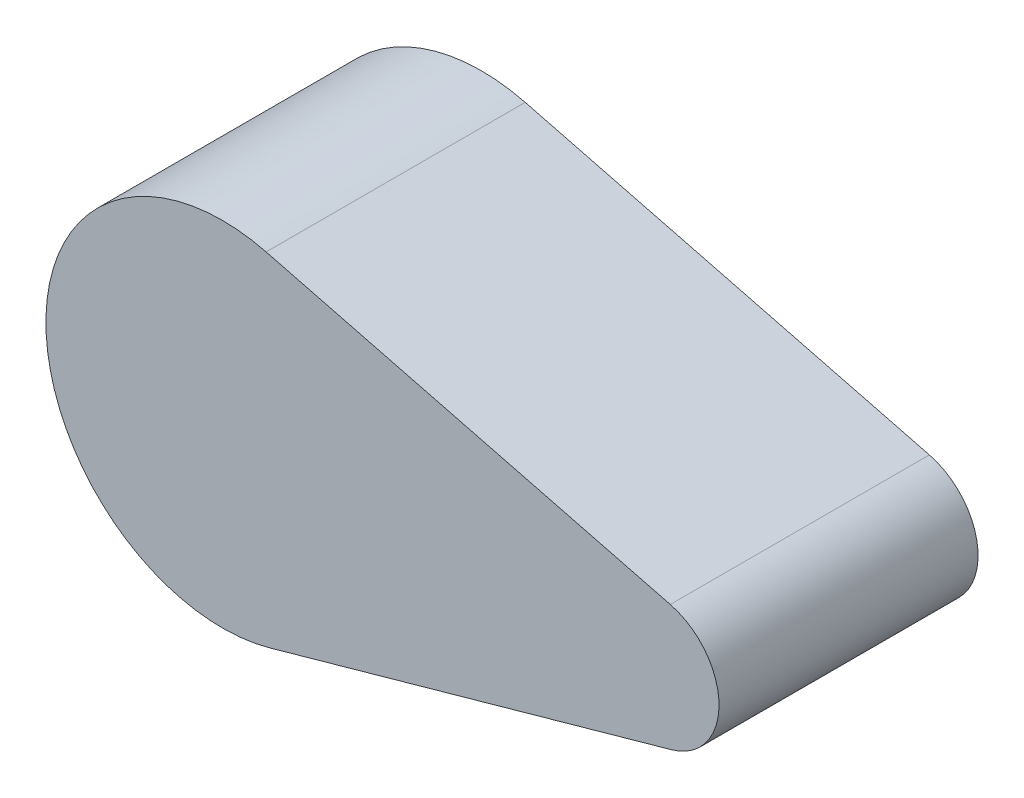
ISO-10303-21;
HEADER;
FILE_DESCRIPTION(('STEP AP214'),'2;1');
FILE_NAME('part.step','',(''),(''),'','','');
FILE_SCHEMA(('AUTOMOTIVE_DESIGN { 1 0 10303 214 1 1 1 1 }'));
ENDSEC;
DATA;
#1=APPLICATION_CONTEXT('core data for automotive mechanical design processes');
#2=APPLICATION_PROTOCOL_DEFINITION('international standard','automotive_design',2000,#1);
#3=PRODUCT_CONTEXT('',#1,'mechanical');
#4=PRODUCT('Part','Part','',(#3));
#5=PRODUCT_RELATED_PRODUCT_CATEGORY('part','',(#4));
#6=PRODUCT_DEFINITION_FORMATION('','',#4);
#7=PRODUCT_DEFINITION_CONTEXT('part definition',#1,'design');
#8=PRODUCT_DEFINITION('design','',#6,#7);
#9=PRODUCT_DEFINITION_SHAPE('','',#8);
#10=(LENGTH_UNIT() NAMED_UNIT(*) SI_UNIT(.MILLI.,.METRE.));
#11=(NAMED_UNIT(*) PLANE_ANGLE_UNIT() SI_UNIT($,.RADIAN.));
#12=(NAMED_UNIT(*) SI_UNIT($,.STERADIAN.) SOLID_ANGLE_UNIT());
#13=UNCERTAINTY_MEASURE_WITH_UNIT(LENGTH_MEASURE(1.E-05),#10,'distance_accuracy_value','');
#14=(GEOMETRIC_REPRESENTATION_CONTEXT(3) GLOBAL_UNCERTAINTY_ASSIGNED_CONTEXT((#13)) GLOBAL_UNIT_ASSIGNED_CONTEXT((#10,
#11,#12)) REPRESENTATION_CONTEXT('',''));
#15=CARTESIAN_POINT('',(0.,0.,0.));
#16=DIRECTION('',(0.,0.,1.));
#17=DIRECTION('',(1.,0.,0.));
#18=AXIS2_PLACEMENT_3D('',#15,#16,#17);
#19=CARTESIAN_POINT('',(0.,0.,-152.4));
#20=DIRECTION('',(0.,0.,1.));
#21=DIRECTION('',(1.,0.,0.));
#22=AXIS2_PLACEMENT_3D('',#19,#20,#21);
#23=CYLINDRICAL_SURFACE('',#22,103.844512637543);
#24=CARTESIAN_POINT('',(0.,0.,0.));
#25=DIRECTION('',(0.,0.,1.));
#26=DIRECTION('',(-1.,0.,0.));
#27=AXIS2_PLACEMENT_3D('',#24,#25,#26);
#28=CIRCLE('',#27,103.844512637543);
#29=CARTESIAN_POINT('',(25.7047722538508,100.612859457956,0.));
#30=VERTEX_POINT('',#29);
#31=CARTESIAN_POINT('',(28.0454439586501,-99.9856783649089,0.));
#32=VERTEX_POINT('',#31);
#33=EDGE_CURVE('E95',#30,#32,#28,.T.);
#34=ORIENTED_EDGE('',*,*,#33,.F.);
#35=DIRECTION('',(0.,0.,1.));
#36=VECTOR('',#35,1.);
#37=CARTESIAN_POINT('',(25.7047722538508,100.612859457956,-152.4));
#38=LINE('',#37,#36);
#39=CARTESIAN_POINT('',(25.7047722538508,100.612859457956,-152.4));
#40=VERTEX_POINT('',#39);
#41=EDGE_CURVE('E11',#40,#30,#38,.T.);
#42=ORIENTED_EDGE('',*,*,#41,.F.);
#43=CARTESIAN_POINT('',(0.,0.,-152.4));
#44=DIRECTION('',(0.,0.,1.));
#45=DIRECTION('',(-1.,0.,0.));
#46=AXIS2_PLACEMENT_3D('',#43,#44,#45);
#47=CIRCLE('',#46,103.844512637543);
#48=CARTESIAN_POINT('',(28.0454439586501,-99.9856783649089,-152.4));
#49=VERTEX_POINT('',#48);
#50=EDGE_CURVE('E89',#40,#49,#47,.T.);
#51=ORIENTED_EDGE('',*,*,#50,.T.);
#52=DIRECTION('',(0.,0.,1.));
#53=VECTOR('',#52,1.);
#54=CARTESIAN_POINT('',(28.0454439586501,-99.9856783649089,-152.4));
#55=LINE('',#54,#53);
#56=EDGE_CURVE('E34',#49,#32,#55,.T.);
#57=ORIENTED_EDGE('',*,*,#56,.T.);
#58=EDGE_LOOP('',(#34,#42,#51,#57));
#59=FACE_BOUND('',#58,.T.);
#60=ADVANCED_FACE('F31',(#59),#23,.T.);
#61=CARTESIAN_POINT('',(25.7047722538508,100.612859457956,-152.4));
#62=DIRECTION('',(0.247531348561193,0.968879884959677,0.));
#63=DIRECTION('',(-0.968879884959677,0.247531348561193,0.));
#64=AXIS2_PLACEMENT_3D('',#61,#62,#63);
#65=PLANE('',#64);
#66=DIRECTION('',(-0.968879884959677,0.247531348561193,0.));
#67=VECTOR('',#66,1.);
#68=CARTESIAN_POINT('',(25.7047722538508,100.612859457956,0.));
#69=LINE('',#68,#67);
#70=CARTESIAN_POINT('',(263.430944380181,39.8781069997918,0.));
#71=VERTEX_POINT('',#70);
#72=EDGE_CURVE('E91',#71,#30,#69,.T.);
#73=ORIENTED_EDGE('',*,*,#72,.F.);
#74=DIRECTION('',(0.,0.,1.));
#75=VECTOR('',#74,1.);
#76=CARTESIAN_POINT('',(263.430944380181,39.8781069997918,-152.4));
#77=LINE('',#76,#75);
#78=CARTESIAN_POINT('',(263.430944380181,39.8781069997918,-152.4));
#79=VERTEX_POINT('',#78);
#80=EDGE_CURVE('E40',#79,#71,#77,.T.);
#81=ORIENTED_EDGE('',*,*,#80,.F.);
#82=DIRECTION('',(-0.968879884959677,0.247531348561193,0.));
#83=VECTOR('',#82,1.);
#84=CARTESIAN_POINT('',(25.7047722538508,100.612859457956,-152.4));
#85=LINE('',#84,#83);
#86=EDGE_CURVE('E86',#79,#40,#85,.T.);
#87=ORIENTED_EDGE('',*,*,#86,.T.);
#88=ORIENTED_EDGE('',*,*,#41,.T.);
#89=EDGE_LOOP('',(#73,#81,#87,#88));
#90=FACE_BOUND('',#89,.T.);
#91=ADVANCED_FACE('F105',(#90),#65,.T.);
#92=CARTESIAN_POINT('',(254.,2.96378338282808,-152.4));
#93=DIRECTION('',(0.,0.,1.));
#94=DIRECTION('',(1.,0.,0.));
#95=AXIS2_PLACEMENT_3D('',#92,#93,#94);
#96=CYLINDRICAL_SURFACE('',#95,38.1);
#97=CARTESIAN_POINT('',(254.,2.96378338282808,0.));
#98=DIRECTION('',(0.,0.,1.));
#99=DIRECTION('',(1.,0.,0.));
#100=AXIS2_PLACEMENT_3D('',#97,#98,#99);
#101=CIRCLE('',#100,38.1);
#102=CARTESIAN_POINT('',(264.289724393567,-33.7204308230731,0.));
#103=VERTEX_POINT('',#102);
#104=EDGE_CURVE('E81',#103,#71,#101,.T.);
#105=ORIENTED_EDGE('',*,*,#104,.F.);
#106=DIRECTION('',(0.,0.,1.));
#107=VECTOR('',#106,1.);
#108=CARTESIAN_POINT('',(264.289724393567,-33.7204308230731,-152.4));
#109=LINE('',#108,#107);
#110=CARTESIAN_POINT('',(264.289724393567,-33.7204308230731,-152.4));
#111=VERTEX_POINT('',#110);
#112=EDGE_CURVE('E76',#111,#103,#109,.T.);
#113=ORIENTED_EDGE('',*,*,#112,.F.);
#114=CARTESIAN_POINT('',(254.,2.96378338282808,-152.4));
#115=DIRECTION('',(0.,0.,1.));
#116=DIRECTION('',(1.,0.,0.));
#117=AXIS2_PLACEMENT_3D('',#114,#115,#116);
#118=CIRCLE('',#117,38.1);
#119=EDGE_CURVE('E79',#111,#79,#118,.T.);
#120=ORIENTED_EDGE('',*,*,#119,.T.);
#121=ORIENTED_EDGE('',*,*,#80,.T.);
#122=EDGE_LOOP('',(#105,#113,#120,#121));
#123=FACE_BOUND('',#122,.T.);
#124=ADVANCED_FACE('F78',(#123),#96,.T.);
#125=CARTESIAN_POINT('',(28.0454439586501,-99.9856783649089,-152.4));
#126=DIRECTION('',(0.270071506392826,-0.962840267871421,0.));
#127=DIRECTION('',(0.962840267871421,0.270071506392826,0.));
#128=AXIS2_PLACEMENT_3D('',#125,#126,#127);
#129=PLANE('',#128);
#130=DIRECTION('',(0.962840267871421,0.270071506392826,0.));
#131=VECTOR('',#130,1.);
#132=CARTESIAN_POINT('',(28.0454439586501,-99.9856783649089,0.));
#133=LINE('',#132,#131);
#134=EDGE_CURVE('E98',#32,#103,#133,.T.);
#135=ORIENTED_EDGE('',*,*,#134,.F.);
#136=ORIENTED_EDGE('',*,*,#56,.F.);
#137=DIRECTION('',(0.962840267871421,0.270071506392826,0.));
#138=VECTOR('',#137,1.);
#139=CARTESIAN_POINT('',(28.0454439586501,-99.9856783649089,-152.4));
#140=LINE('',#139,#138);
#141=EDGE_CURVE('E85',#49,#111,#140,.T.);
#142=ORIENTED_EDGE('',*,*,#141,.T.);
#143=ORIENTED_EDGE('',*,*,#112,.T.);
#144=EDGE_LOOP('',(#135,#136,#142,#143));
#145=FACE_BOUND('',#144,.T.);
#146=ADVANCED_FACE('F88',(#145),#129,.T.);
#147=CARTESIAN_POINT('',(0.,0.,-152.4));
#148=DIRECTION('',(0.,0.,-1.));
#149=DIRECTION('',(-1.,0.,0.));
#150=AXIS2_PLACEMENT_3D('',#147,#148,#149);
#151=PLANE('',#150);
#152=ORIENTED_EDGE('',*,*,#50,.F.);
#153=ORIENTED_EDGE('',*,*,#86,.F.);
#154=ORIENTED_EDGE('',*,*,#119,.F.);
#155=ORIENTED_EDGE('',*,*,#141,.F.);
#156=EDGE_LOOP('',(#152,#153,#154,#155));
#157=FACE_BOUND('',#156,.T.);
#158=ADVANCED_FACE('F84',(#157),#151,.T.);
#159=CARTESIAN_POINT('',(0.,0.,0.));
#160=DIRECTION('',(0.,0.,-1.));
#161=DIRECTION('',(-1.,0.,0.));
#162=AXIS2_PLACEMENT_3D('',#159,#160,#161);
#163=PLANE('',#162);
#164=ORIENTED_EDGE('',*,*,#33,.T.);
#165=ORIENTED_EDGE('',*,*,#134,.T.);
#166=ORIENTED_EDGE('',*,*,#104,.T.);
#167=ORIENTED_EDGE('',*,*,#72,.T.);
#168=EDGE_LOOP('',(#164,#165,#166,#167));
#169=FACE_BOUND('',#168,.T.);
#170=ADVANCED_FACE('F104',(#169),#163,.F.);
#171=CLOSED_SHELL('',(#60,#91,#124,#146,#158,#170));
#172=MANIFOLD_SOLID_BREP('B2',#171);
#173=ADVANCED_BREP_SHAPE_REPRESENTATION('',(#18,#172),#14);
#174=SHAPE_DEFINITION_REPRESENTATION(#9,#173);
ENDSEC;
END-ISO-10303-21;
